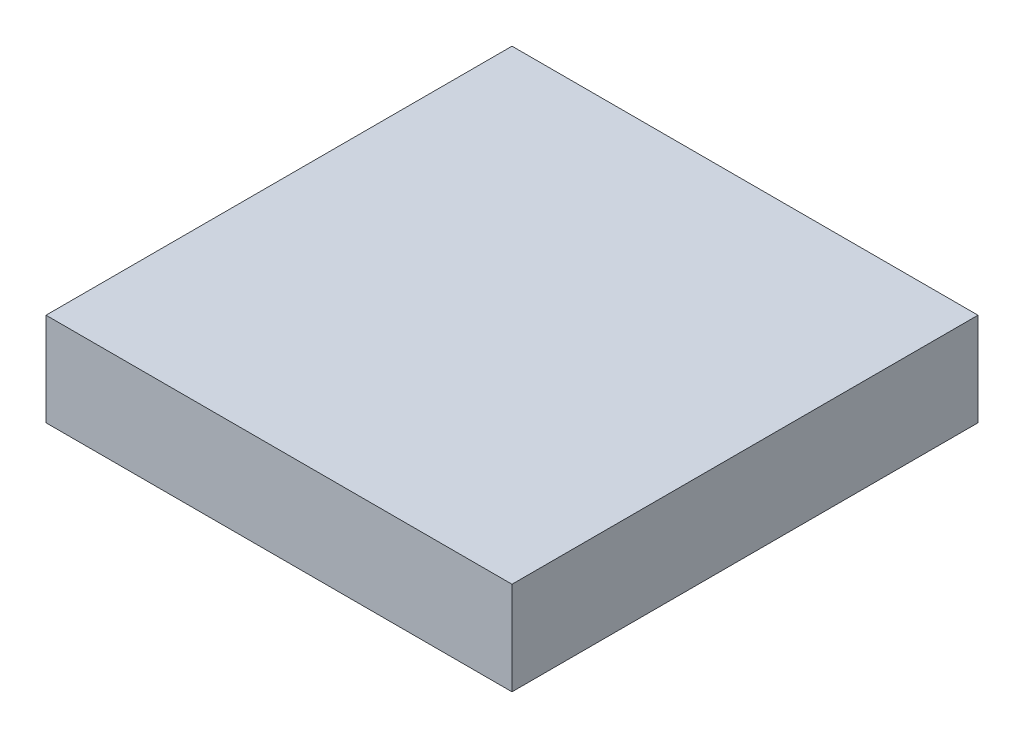
ISO-10303-21;
HEADER;
FILE_DESCRIPTION(('STEP AP214'),'2;1');
FILE_NAME('part.step','',(''),(''),'','','');
FILE_SCHEMA(('AUTOMOTIVE_DESIGN { 1 0 10303 214 1 1 1 1 }'));
ENDSEC;
DATA;
#1=APPLICATION_CONTEXT('core data for automotive mechanical design processes');
#2=APPLICATION_PROTOCOL_DEFINITION('international standard','automotive_design',2000,#1);
#3=PRODUCT_CONTEXT('',#1,'mechanical');
#4=PRODUCT('Part','Part','',(#3));
#5=PRODUCT_RELATED_PRODUCT_CATEGORY('part','',(#4));
#6=PRODUCT_DEFINITION_FORMATION('','',#4);
#7=PRODUCT_DEFINITION_CONTEXT('part definition',#1,'design');
#8=PRODUCT_DEFINITION('design','',#6,#7);
#9=PRODUCT_DEFINITION_SHAPE('','',#8);
#10=(LENGTH_UNIT() NAMED_UNIT(*) SI_UNIT(.MILLI.,.METRE.));
#11=(NAMED_UNIT(*) PLANE_ANGLE_UNIT() SI_UNIT($,.RADIAN.));
#12=(NAMED_UNIT(*) SI_UNIT($,.STERADIAN.) SOLID_ANGLE_UNIT());
#13=UNCERTAINTY_MEASURE_WITH_UNIT(LENGTH_MEASURE(1.E-05),#10,'distance_accuracy_value','');
#14=(GEOMETRIC_REPRESENTATION_CONTEXT(3) GLOBAL_UNCERTAINTY_ASSIGNED_CONTEXT((#13)) GLOBAL_UNIT_ASSIGNED_CONTEXT((#10,
#11,#12)) REPRESENTATION_CONTEXT('',''));
#15=CARTESIAN_POINT('',(0.,0.,0.));
#16=DIRECTION('',(0.,0.,1.));
#17=DIRECTION('',(1.,0.,0.));
#18=AXIS2_PLACEMENT_3D('',#15,#16,#17);
#19=CARTESIAN_POINT('',(12.7,5.08,12.7));
#20=DIRECTION('',(-1.,0.,0.));
#21=DIRECTION('',(0.,0.,1.));
#22=AXIS2_PLACEMENT_3D('',#19,#20,#21);
#23=PLANE('',#22);
#24=DIRECTION('',(0.,0.,-1.));
#25=VECTOR('',#24,1.);
#26=CARTESIAN_POINT('',(12.7,0.,12.7));
#27=LINE('',#26,#25);
#28=CARTESIAN_POINT('',(12.7,0.,12.7));
#29=VERTEX_POINT('',#28);
#30=CARTESIAN_POINT('',(12.7,0.,-12.7));
#31=VERTEX_POINT('',#30);
#32=EDGE_CURVE('E101',#29,#31,#27,.T.);
#33=ORIENTED_EDGE('',*,*,#32,.T.);
#34=DIRECTION('',(0.,-1.,0.));
#35=VECTOR('',#34,1.);
#36=CARTESIAN_POINT('',(12.7,5.08,-12.7));
#37=LINE('',#36,#35);
#38=CARTESIAN_POINT('',(12.7,5.08,-12.7));
#39=VERTEX_POINT('',#38);
#40=EDGE_CURVE('E11',#39,#31,#37,.T.);
#41=ORIENTED_EDGE('',*,*,#40,.F.);
#42=DIRECTION('',(0.,0.,-1.));
#43=VECTOR('',#42,1.);
#44=CARTESIAN_POINT('',(12.7,5.08,12.7));
#45=LINE('',#44,#43);
#46=CARTESIAN_POINT('',(12.7,5.08,12.7));
#47=VERTEX_POINT('',#46);
#48=EDGE_CURVE('E89',#47,#39,#45,.T.);
#49=ORIENTED_EDGE('',*,*,#48,.F.);
#50=DIRECTION('',(0.,-1.,0.));
#51=VECTOR('',#50,1.);
#52=CARTESIAN_POINT('',(12.7,5.08,12.7));
#53=LINE('',#52,#51);
#54=EDGE_CURVE('E97',#47,#29,#53,.T.);
#55=ORIENTED_EDGE('',*,*,#54,.T.);
#56=EDGE_LOOP('',(#33,#41,#49,#55));
#57=FACE_BOUND('',#56,.T.);
#58=ADVANCED_FACE('F38',(#57),#23,.F.);
#59=CARTESIAN_POINT('',(-12.7,5.08,-12.7));
#60=DIRECTION('',(0.,0.,1.));
#61=DIRECTION('',(1.,0.,0.));
#62=AXIS2_PLACEMENT_3D('',#59,#60,#61);
#63=PLANE('',#62);
#64=DIRECTION('',(-1.,0.,0.));
#65=VECTOR('',#64,1.);
#66=CARTESIAN_POINT('',(-12.7,0.,-12.7));
#67=LINE('',#66,#65);
#68=CARTESIAN_POINT('',(-12.7,0.,-12.7));
#69=VERTEX_POINT('',#68);
#70=EDGE_CURVE('E93',#31,#69,#67,.T.);
#71=ORIENTED_EDGE('',*,*,#70,.T.);
#72=DIRECTION('',(0.,-1.,0.));
#73=VECTOR('',#72,1.);
#74=CARTESIAN_POINT('',(-12.7,5.08,-12.7));
#75=LINE('',#74,#73);
#76=CARTESIAN_POINT('',(-12.7,5.08,-12.7));
#77=VERTEX_POINT('',#76);
#78=EDGE_CURVE('E46',#77,#69,#75,.T.);
#79=ORIENTED_EDGE('',*,*,#78,.F.);
#80=DIRECTION('',(-1.,0.,0.));
#81=VECTOR('',#80,1.);
#82=CARTESIAN_POINT('',(-12.7,5.08,-12.7));
#83=LINE('',#82,#81);
#84=EDGE_CURVE('E84',#39,#77,#83,.T.);
#85=ORIENTED_EDGE('',*,*,#84,.F.);
#86=ORIENTED_EDGE('',*,*,#40,.T.);
#87=EDGE_LOOP('',(#71,#79,#85,#86));
#88=FACE_BOUND('',#87,.T.);
#89=ADVANCED_FACE('F92',(#88),#63,.F.);
#90=CARTESIAN_POINT('',(-12.7,5.08,12.7));
#91=DIRECTION('',(1.,0.,0.));
#92=DIRECTION('',(0.,0.,-1.));
#93=AXIS2_PLACEMENT_3D('',#90,#91,#92);
#94=PLANE('',#93);
#95=DIRECTION('',(0.,0.,1.));
#96=VECTOR('',#95,1.);
#97=CARTESIAN_POINT('',(-12.7,0.,12.7));
#98=LINE('',#97,#96);
#99=CARTESIAN_POINT('',(-12.7,0.,12.7));
#100=VERTEX_POINT('',#99);
#101=EDGE_CURVE('E71',#69,#100,#98,.T.);
#102=ORIENTED_EDGE('',*,*,#101,.T.);
#103=DIRECTION('',(0.,-1.,0.));
#104=VECTOR('',#103,1.);
#105=CARTESIAN_POINT('',(-12.7,5.08,12.7));
#106=LINE('',#105,#104);
#107=CARTESIAN_POINT('',(-12.7,5.08,12.7));
#108=VERTEX_POINT('',#107);
#109=EDGE_CURVE('E94',#108,#100,#106,.T.);
#110=ORIENTED_EDGE('',*,*,#109,.F.);
#111=DIRECTION('',(0.,0.,1.));
#112=VECTOR('',#111,1.);
#113=CARTESIAN_POINT('',(-12.7,5.08,12.7));
#114=LINE('',#113,#112);
#115=EDGE_CURVE('E87',#77,#108,#114,.T.);
#116=ORIENTED_EDGE('',*,*,#115,.F.);
#117=ORIENTED_EDGE('',*,*,#78,.T.);
#118=EDGE_LOOP('',(#102,#110,#116,#117));
#119=FACE_BOUND('',#118,.T.);
#120=ADVANCED_FACE('F95',(#119),#94,.F.);
#121=CARTESIAN_POINT('',(-12.7,5.08,12.7));
#122=DIRECTION('',(0.,0.,-1.));
#123=DIRECTION('',(-1.,0.,0.));
#124=AXIS2_PLACEMENT_3D('',#121,#122,#123);
#125=PLANE('',#124);
#126=DIRECTION('',(1.,0.,0.));
#127=VECTOR('',#126,1.);
#128=CARTESIAN_POINT('',(-12.7,0.,12.7));
#129=LINE('',#128,#127);
#130=EDGE_CURVE('E77',#100,#29,#129,.T.);
#131=ORIENTED_EDGE('',*,*,#130,.T.);
#132=ORIENTED_EDGE('',*,*,#54,.F.);
#133=DIRECTION('',(1.,0.,0.));
#134=VECTOR('',#133,1.);
#135=CARTESIAN_POINT('',(-12.7,5.08,12.7));
#136=LINE('',#135,#134);
#137=EDGE_CURVE('E54',#108,#47,#136,.T.);
#138=ORIENTED_EDGE('',*,*,#137,.F.);
#139=ORIENTED_EDGE('',*,*,#109,.T.);
#140=EDGE_LOOP('',(#131,#132,#138,#139));
#141=FACE_BOUND('',#140,.T.);
#142=ADVANCED_FACE('F108',(#141),#125,.F.);
#143=CARTESIAN_POINT('',(0.,5.08,0.));
#144=DIRECTION('',(0.,-1.,0.));
#145=DIRECTION('',(0.,0.,-1.));
#146=AXIS2_PLACEMENT_3D('',#143,#144,#145);
#147=PLANE('',#146);
#148=ORIENTED_EDGE('',*,*,#48,.T.);
#149=ORIENTED_EDGE('',*,*,#84,.T.);
#150=ORIENTED_EDGE('',*,*,#115,.T.);
#151=ORIENTED_EDGE('',*,*,#137,.T.);
#152=EDGE_LOOP('',(#148,#149,#150,#151));
#153=FACE_BOUND('',#152,.T.);
#154=ADVANCED_FACE('F85',(#153),#147,.F.);
#155=CARTESIAN_POINT('',(0.,0.,0.));
#156=DIRECTION('',(0.,-1.,0.));
#157=DIRECTION('',(0.,0.,-1.));
#158=AXIS2_PLACEMENT_3D('',#155,#156,#157);
#159=PLANE('',#158);
#160=ORIENTED_EDGE('',*,*,#32,.F.);
#161=ORIENTED_EDGE('',*,*,#130,.F.);
#162=ORIENTED_EDGE('',*,*,#101,.F.);
#163=ORIENTED_EDGE('',*,*,#70,.F.);
#164=EDGE_LOOP('',(#160,#161,#162,#163));
#165=FACE_BOUND('',#164,.T.);
#166=ADVANCED_FACE('F111',(#165),#159,.T.);
#167=CLOSED_SHELL('',(#58,#89,#120,#142,#154,#166));
#168=MANIFOLD_SOLID_BREP('B2',#167);
#169=ADVANCED_BREP_SHAPE_REPRESENTATION('',(#18,#168),#14);
#170=SHAPE_DEFINITION_REPRESENTATION(#9,#169);
ENDSEC;
END-ISO-10303-21;
